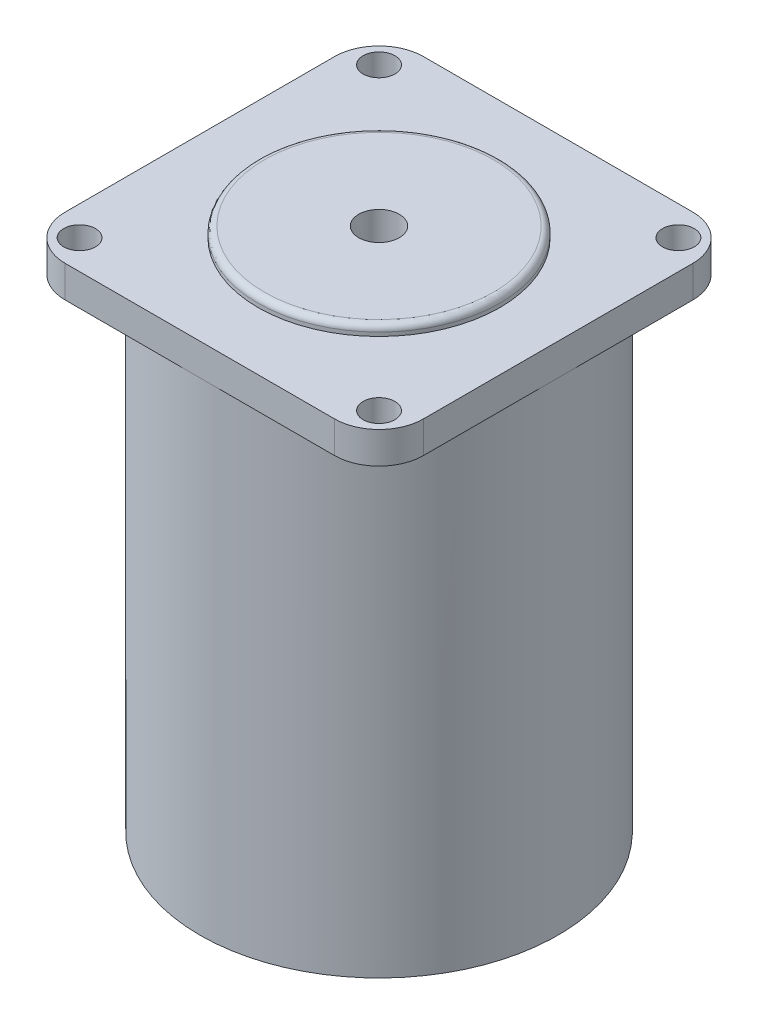
ISO-10303-21;
HEADER;
FILE_DESCRIPTION(('STEP AP214'),'2;1');
FILE_NAME('part.step','',(''),(''),'','','');
FILE_SCHEMA(('AUTOMOTIVE_DESIGN { 1 0 10303 214 1 1 1 1 }'));
ENDSEC;
DATA;
#1=APPLICATION_CONTEXT('core data for automotive mechanical design processes');
#2=APPLICATION_PROTOCOL_DEFINITION('international standard','automotive_design',2000,#1);
#3=PRODUCT_CONTEXT('',#1,'mechanical');
#4=PRODUCT('Part','Part','',(#3));
#5=PRODUCT_RELATED_PRODUCT_CATEGORY('part','',(#4));
#6=PRODUCT_DEFINITION_FORMATION('','',#4);
#7=PRODUCT_DEFINITION_CONTEXT('part definition',#1,'design');
#8=PRODUCT_DEFINITION('design','',#6,#7);
#9=PRODUCT_DEFINITION_SHAPE('','',#8);
#10=(LENGTH_UNIT() NAMED_UNIT(*) SI_UNIT(.MILLI.,.METRE.));
#11=(NAMED_UNIT(*) PLANE_ANGLE_UNIT() SI_UNIT($,.RADIAN.));
#12=(NAMED_UNIT(*) SI_UNIT($,.STERADIAN.) SOLID_ANGLE_UNIT());
#13=UNCERTAINTY_MEASURE_WITH_UNIT(LENGTH_MEASURE(1.E-05),#10,'distance_accuracy_value','');
#14=(GEOMETRIC_REPRESENTATION_CONTEXT(3) GLOBAL_UNCERTAINTY_ASSIGNED_CONTEXT((#13)) GLOBAL_UNIT_ASSIGNED_CONTEXT((#10,
#11,#12)) REPRESENTATION_CONTEXT('',''));
#15=CARTESIAN_POINT('',(0.,0.,0.));
#16=DIRECTION('',(0.,0.,1.));
#17=DIRECTION('',(1.,0.,0.));
#18=AXIS2_PLACEMENT_3D('',#15,#16,#17);
#19=CARTESIAN_POINT('',(0.,76.,0.));
#20=DIRECTION('',(0.,-1.,0.));
#21=DIRECTION('',(0.,0.,-1.));
#22=AXIS2_PLACEMENT_3D('',#19,#20,#21);
#23=CYLINDRICAL_SURFACE('',#22,28.2);
#24=CARTESIAN_POINT('',(0.,76.,0.));
#25=DIRECTION('',(0.,1.,0.));
#26=DIRECTION('',(0.,0.,1.));
#27=AXIS2_PLACEMENT_3D('',#24,#25,#26);
#28=CIRCLE('',#27,28.2);
#29=CARTESIAN_POINT('',(0.,76.,28.2));
#30=VERTEX_POINT('',#29);
#31=CARTESIAN_POINT('',(28.2,76.,0.));
#32=VERTEX_POINT('',#31);
#33=EDGE_CURVE('E141',#30,#32,#28,.T.);
#34=ORIENTED_EDGE('',*,*,#33,.F.);
#35=CARTESIAN_POINT('',(-28.2,76.,0.));
#36=VERTEX_POINT('',#35);
#37=EDGE_CURVE('E47',#36,#30,#28,.T.);
#38=ORIENTED_EDGE('',*,*,#37,.F.);
#39=CARTESIAN_POINT('',(0.,76.,-28.2));
#40=VERTEX_POINT('',#39);
#41=EDGE_CURVE('E51',#40,#36,#28,.T.);
#42=ORIENTED_EDGE('',*,*,#41,.F.);
#43=EDGE_CURVE('E143',#32,#40,#28,.T.);
#44=ORIENTED_EDGE('',*,*,#43,.F.);
#45=EDGE_LOOP('',(#34,#38,#42,#44));
#46=FACE_BOUND('',#45,.T.);
#47=CARTESIAN_POINT('',(0.,0.,0.));
#48=DIRECTION('',(0.,1.,0.));
#49=DIRECTION('',(0.,0.,1.));
#50=AXIS2_PLACEMENT_3D('',#47,#48,#49);
#51=CIRCLE('',#50,28.2);
#52=CARTESIAN_POINT('',(0.,0.,28.2));
#53=VERTEX_POINT('',#52);
#54=EDGE_CURVE('E133',#53,#53,#51,.T.);
#55=ORIENTED_EDGE('',*,*,#54,.T.);
#56=EDGE_LOOP('',(#55));
#57=FACE_BOUND('',#56,.T.);
#58=ADVANCED_FACE('F32',(#46,#57),#23,.T.);
#59=CARTESIAN_POINT('',(0.,0.,0.));
#60=DIRECTION('',(0.,1.,0.));
#61=DIRECTION('',(0.,0.,1.));
#62=AXIS2_PLACEMENT_3D('',#59,#60,#61);
#63=PLANE('',#62);
#64=CARTESIAN_POINT('',(0.,0.,0.));
#65=DIRECTION('',(0.,1.,0.));
#66=DIRECTION('',(0.,0.,1.));
#67=AXIS2_PLACEMENT_3D('',#64,#65,#66);
#68=CIRCLE('',#67,3.2);
#69=CARTESIAN_POINT('',(0.,0.,3.2));
#70=VERTEX_POINT('',#69);
#71=EDGE_CURVE('E233',#70,#70,#68,.T.);
#72=ORIENTED_EDGE('',*,*,#71,.T.);
#73=EDGE_LOOP('',(#72));
#74=FACE_BOUND('',#73,.T.);
#75=ORIENTED_EDGE('',*,*,#54,.F.);
#76=EDGE_LOOP('',(#75));
#77=FACE_BOUND('',#76,.T.);
#78=ADVANCED_FACE('F163',(#74,#77),#63,.F.);
#79=CARTESIAN_POINT('',(-21.2,76.,-21.2));
#80=DIRECTION('',(0.,1.,0.));
#81=DIRECTION('',(0.,0.,1.));
#82=AXIS2_PLACEMENT_3D('',#79,#80,#81);
#83=PLANE('',#82);
#84=CARTESIAN_POINT('',(23.57,76.,23.57));
#85=DIRECTION('',(0.,1.,0.));
#86=DIRECTION('',(0.,0.,1.));
#87=AXIS2_PLACEMENT_3D('',#84,#85,#86);
#88=CIRCLE('',#87,2.5);
#89=CARTESIAN_POINT('',(23.57,76.,26.07));
#90=VERTEX_POINT('',#89);
#91=EDGE_CURVE('E236',#90,#90,#88,.T.);
#92=ORIENTED_EDGE('',*,*,#91,.T.);
#93=EDGE_LOOP('',(#92));
#94=FACE_BOUND('',#93,.T.);
#95=DIRECTION('',(1.,0.,0.));
#96=VECTOR('',#95,1.);
#97=CARTESIAN_POINT('',(-21.2,76.,28.2));
#98=LINE('',#97,#96);
#99=CARTESIAN_POINT('',(21.2,76.,28.2));
#100=VERTEX_POINT('',#99);
#101=EDGE_CURVE('E280',#30,#100,#98,.T.);
#102=ORIENTED_EDGE('',*,*,#101,.F.);
#103=ORIENTED_EDGE('',*,*,#33,.T.);
#104=DIRECTION('',(0.,0.,-1.));
#105=VECTOR('',#104,1.);
#106=CARTESIAN_POINT('',(28.2,76.,21.2));
#107=LINE('',#106,#105);
#108=CARTESIAN_POINT('',(28.2,76.,21.2));
#109=VERTEX_POINT('',#108);
#110=EDGE_CURVE('E287',#109,#32,#107,.T.);
#111=ORIENTED_EDGE('',*,*,#110,.F.);
#112=CARTESIAN_POINT('',(21.2,76.,21.2));
#113=DIRECTION('',(0.,1.,0.));
#114=DIRECTION('',(0.,0.,1.));
#115=AXIS2_PLACEMENT_3D('',#112,#113,#114);
#116=CIRCLE('',#115,7.);
#117=EDGE_CURVE('E284',#100,#109,#116,.T.);
#118=ORIENTED_EDGE('',*,*,#117,.F.);
#119=EDGE_LOOP('',(#102,#103,#111,#118));
#120=FACE_BOUND('',#119,.T.);
#121=ADVANCED_FACE('F167',(#94,#120),#83,.F.);
#122=CARTESIAN_POINT('',(23.57,76.,-23.57));
#123=DIRECTION('',(0.,1.,0.));
#124=DIRECTION('',(0.,0.,1.));
#125=AXIS2_PLACEMENT_3D('',#122,#123,#124);
#126=CIRCLE('',#125,2.5);
#127=CARTESIAN_POINT('',(23.57,76.,-21.07));
#128=VERTEX_POINT('',#127);
#129=EDGE_CURVE('E246',#128,#128,#126,.T.);
#130=ORIENTED_EDGE('',*,*,#129,.T.);
#131=EDGE_LOOP('',(#130));
#132=FACE_BOUND('',#131,.T.);
#133=CARTESIAN_POINT('',(28.2,76.,-21.2));
#134=VERTEX_POINT('',#133);
#135=EDGE_CURVE('E286',#32,#134,#107,.T.);
#136=ORIENTED_EDGE('',*,*,#135,.F.);
#137=ORIENTED_EDGE('',*,*,#43,.T.);
#138=DIRECTION('',(-1.,0.,0.));
#139=VECTOR('',#138,1.);
#140=CARTESIAN_POINT('',(-21.2,76.,-28.2));
#141=LINE('',#140,#139);
#142=CARTESIAN_POINT('',(21.2,76.,-28.2));
#143=VERTEX_POINT('',#142);
#144=EDGE_CURVE('E128',#143,#40,#141,.T.);
#145=ORIENTED_EDGE('',*,*,#144,.F.);
#146=CARTESIAN_POINT('',(21.2,76.,-21.2));
#147=DIRECTION('',(0.,1.,0.));
#148=DIRECTION('',(0.,0.,1.));
#149=AXIS2_PLACEMENT_3D('',#146,#147,#148);
#150=CIRCLE('',#149,7.);
#151=EDGE_CURVE('E290',#134,#143,#150,.T.);
#152=ORIENTED_EDGE('',*,*,#151,.F.);
#153=EDGE_LOOP('',(#136,#137,#145,#152));
#154=FACE_BOUND('',#153,.T.);
#155=ADVANCED_FACE('F203',(#132,#154),#83,.F.);
#156=CARTESIAN_POINT('',(-23.57,76.,-23.57));
#157=DIRECTION('',(0.,1.,0.));
#158=DIRECTION('',(0.,0.,1.));
#159=AXIS2_PLACEMENT_3D('',#156,#157,#158);
#160=CIRCLE('',#159,2.5);
#161=CARTESIAN_POINT('',(-23.57,76.,-21.07));
#162=VERTEX_POINT('',#161);
#163=EDGE_CURVE('E258',#162,#162,#160,.T.);
#164=ORIENTED_EDGE('',*,*,#163,.T.);
#165=EDGE_LOOP('',(#164));
#166=FACE_BOUND('',#165,.T.);
#167=CARTESIAN_POINT('',(-21.2,76.,-28.2));
#168=VERTEX_POINT('',#167);
#169=EDGE_CURVE('E292',#40,#168,#141,.T.);
#170=ORIENTED_EDGE('',*,*,#169,.F.);
#171=ORIENTED_EDGE('',*,*,#41,.T.);
#172=DIRECTION('',(0.,0.,1.));
#173=VECTOR('',#172,1.);
#174=CARTESIAN_POINT('',(-28.2,76.,21.2));
#175=LINE('',#174,#173);
#176=CARTESIAN_POINT('',(-28.2,76.,-21.2));
#177=VERTEX_POINT('',#176);
#178=EDGE_CURVE('E276',#177,#36,#175,.T.);
#179=ORIENTED_EDGE('',*,*,#178,.F.);
#180=CARTESIAN_POINT('',(-21.2,76.,-21.2));
#181=DIRECTION('',(0.,1.,0.));
#182=DIRECTION('',(0.,0.,1.));
#183=AXIS2_PLACEMENT_3D('',#180,#181,#182);
#184=CIRCLE('',#183,7.);
#185=EDGE_CURVE('E132',#168,#177,#184,.T.);
#186=ORIENTED_EDGE('',*,*,#185,.F.);
#187=EDGE_LOOP('',(#170,#171,#179,#186));
#188=FACE_BOUND('',#187,.T.);
#189=ADVANCED_FACE('F330',(#166,#188),#83,.F.);
#190=CARTESIAN_POINT('',(-23.57,76.,23.57));
#191=DIRECTION('',(0.,1.,0.));
#192=DIRECTION('',(0.,0.,1.));
#193=AXIS2_PLACEMENT_3D('',#190,#191,#192);
#194=CIRCLE('',#193,2.5);
#195=CARTESIAN_POINT('',(-23.57,76.,26.07));
#196=VERTEX_POINT('',#195);
#197=EDGE_CURVE('E253',#196,#196,#194,.T.);
#198=ORIENTED_EDGE('',*,*,#197,.T.);
#199=EDGE_LOOP('',(#198));
#200=FACE_BOUND('',#199,.T.);
#201=CARTESIAN_POINT('',(-28.2,76.,21.2));
#202=VERTEX_POINT('',#201);
#203=EDGE_CURVE('E275',#36,#202,#175,.T.);
#204=ORIENTED_EDGE('',*,*,#203,.F.);
#205=ORIENTED_EDGE('',*,*,#37,.T.);
#206=CARTESIAN_POINT('',(-21.2,76.,28.2));
#207=VERTEX_POINT('',#206);
#208=EDGE_CURVE('E281',#207,#30,#98,.T.);
#209=ORIENTED_EDGE('',*,*,#208,.F.);
#210=CARTESIAN_POINT('',(-21.2,76.,21.2));
#211=DIRECTION('',(0.,1.,0.));
#212=DIRECTION('',(0.,0.,-1.));
#213=AXIS2_PLACEMENT_3D('',#210,#211,#212);
#214=CIRCLE('',#213,7.);
#215=EDGE_CURVE('E278',#202,#207,#214,.T.);
#216=ORIENTED_EDGE('',*,*,#215,.F.);
#217=EDGE_LOOP('',(#204,#205,#209,#216));
#218=FACE_BOUND('',#217,.T.);
#219=ADVANCED_FACE('F174',(#200,#218),#83,.F.);
#220=CARTESIAN_POINT('',(-21.2,81.,-21.2));
#221=DIRECTION('',(0.,-1.,0.));
#222=DIRECTION('',(0.,0.,-1.));
#223=AXIS2_PLACEMENT_3D('',#220,#221,#222);
#224=CYLINDRICAL_SURFACE('',#223,7.);
#225=ORIENTED_EDGE('',*,*,#185,.T.);
#226=DIRECTION('',(0.,-1.,0.));
#227=VECTOR('',#226,1.);
#228=CARTESIAN_POINT('',(-28.2,81.,-21.2));
#229=LINE('',#228,#227);
#230=CARTESIAN_POINT('',(-28.2,81.,-21.2));
#231=VERTEX_POINT('',#230);
#232=EDGE_CURVE('E112',#231,#177,#229,.T.);
#233=ORIENTED_EDGE('',*,*,#232,.F.);
#234=CARTESIAN_POINT('',(-21.2,81.,-21.2));
#235=DIRECTION('',(0.,1.,0.));
#236=DIRECTION('',(0.,0.,1.));
#237=AXIS2_PLACEMENT_3D('',#234,#235,#236);
#238=CIRCLE('',#237,7.);
#239=CARTESIAN_POINT('',(-21.2,81.,-28.2));
#240=VERTEX_POINT('',#239);
#241=EDGE_CURVE('E119',#240,#231,#238,.T.);
#242=ORIENTED_EDGE('',*,*,#241,.F.);
#243=DIRECTION('',(0.,-1.,0.));
#244=VECTOR('',#243,1.);
#245=CARTESIAN_POINT('',(-21.2,81.,-28.2));
#246=LINE('',#245,#244);
#247=EDGE_CURVE('E273',#240,#168,#246,.T.);
#248=ORIENTED_EDGE('',*,*,#247,.T.);
#249=EDGE_LOOP('',(#225,#233,#242,#248));
#250=FACE_BOUND('',#249,.T.);
#251=ADVANCED_FACE('F130',(#250),#224,.T.);
#252=CARTESIAN_POINT('',(-28.2,81.,21.2));
#253=DIRECTION('',(1.,0.,0.));
#254=DIRECTION('',(0.,0.,-1.));
#255=AXIS2_PLACEMENT_3D('',#252,#253,#254);
#256=PLANE('',#255);
#257=ORIENTED_EDGE('',*,*,#178,.T.);
#258=ORIENTED_EDGE('',*,*,#203,.T.);
#259=DIRECTION('',(0.,-1.,0.));
#260=VECTOR('',#259,1.);
#261=CARTESIAN_POINT('',(-28.2,81.,21.2));
#262=LINE('',#261,#260);
#263=CARTESIAN_POINT('',(-28.2,81.,21.2));
#264=VERTEX_POINT('',#263);
#265=EDGE_CURVE('E115',#264,#202,#262,.T.);
#266=ORIENTED_EDGE('',*,*,#265,.F.);
#267=DIRECTION('',(0.,0.,1.));
#268=VECTOR('',#267,1.);
#269=CARTESIAN_POINT('',(-28.2,81.,21.2));
#270=LINE('',#269,#268);
#271=EDGE_CURVE('E107',#231,#264,#270,.T.);
#272=ORIENTED_EDGE('',*,*,#271,.F.);
#273=ORIENTED_EDGE('',*,*,#232,.T.);
#274=EDGE_LOOP('',(#257,#258,#266,#272,#273));
#275=FACE_BOUND('',#274,.T.);
#276=ADVANCED_FACE('F110',(#275),#256,.F.);
#277=CARTESIAN_POINT('',(-21.2,81.,21.2));
#278=DIRECTION('',(0.,-1.,0.));
#279=DIRECTION('',(0.,0.,-1.));
#280=AXIS2_PLACEMENT_3D('',#277,#278,#279);
#281=CYLINDRICAL_SURFACE('',#280,7.);
#282=ORIENTED_EDGE('',*,*,#215,.T.);
#283=DIRECTION('',(0.,-1.,0.));
#284=VECTOR('',#283,1.);
#285=CARTESIAN_POINT('',(-21.2,81.,28.2));
#286=LINE('',#285,#284);
#287=CARTESIAN_POINT('',(-21.2,81.,28.2));
#288=VERTEX_POINT('',#287);
#289=EDGE_CURVE('E137',#288,#207,#286,.T.);
#290=ORIENTED_EDGE('',*,*,#289,.F.);
#291=CARTESIAN_POINT('',(-21.2,81.,21.2));
#292=DIRECTION('',(0.,1.,0.));
#293=DIRECTION('',(0.,0.,-1.));
#294=AXIS2_PLACEMENT_3D('',#291,#292,#293);
#295=CIRCLE('',#294,7.);
#296=EDGE_CURVE('E118',#264,#288,#295,.T.);
#297=ORIENTED_EDGE('',*,*,#296,.F.);
#298=ORIENTED_EDGE('',*,*,#265,.T.);
#299=EDGE_LOOP('',(#282,#290,#297,#298));
#300=FACE_BOUND('',#299,.T.);
#301=ADVANCED_FACE('F177',(#300),#281,.T.);
#302=CARTESIAN_POINT('',(-21.2,81.,28.2));
#303=DIRECTION('',(0.,0.,-1.));
#304=DIRECTION('',(-1.,0.,0.));
#305=AXIS2_PLACEMENT_3D('',#302,#303,#304);
#306=PLANE('',#305);
#307=ORIENTED_EDGE('',*,*,#208,.T.);
#308=ORIENTED_EDGE('',*,*,#101,.T.);
#309=DIRECTION('',(0.,-1.,0.));
#310=VECTOR('',#309,1.);
#311=CARTESIAN_POINT('',(21.2,81.,28.2));
#312=LINE('',#311,#310);
#313=CARTESIAN_POINT('',(21.2,81.,28.2));
#314=VERTEX_POINT('',#313);
#315=EDGE_CURVE('E305',#314,#100,#312,.T.);
#316=ORIENTED_EDGE('',*,*,#315,.F.);
#317=DIRECTION('',(1.,0.,0.));
#318=VECTOR('',#317,1.);
#319=CARTESIAN_POINT('',(-21.2,81.,28.2));
#320=LINE('',#319,#318);
#321=EDGE_CURVE('E264',#288,#314,#320,.T.);
#322=ORIENTED_EDGE('',*,*,#321,.F.);
#323=ORIENTED_EDGE('',*,*,#289,.T.);
#324=EDGE_LOOP('',(#307,#308,#316,#322,#323));
#325=FACE_BOUND('',#324,.T.);
#326=ADVANCED_FACE('F180',(#325),#306,.F.);
#327=CARTESIAN_POINT('',(21.2,81.,21.2));
#328=DIRECTION('',(0.,-1.,0.));
#329=DIRECTION('',(0.,0.,-1.));
#330=AXIS2_PLACEMENT_3D('',#327,#328,#329);
#331=CYLINDRICAL_SURFACE('',#330,7.);
#332=ORIENTED_EDGE('',*,*,#117,.T.);
#333=DIRECTION('',(0.,-1.,0.));
#334=VECTOR('',#333,1.);
#335=CARTESIAN_POINT('',(28.2,81.,21.2));
#336=LINE('',#335,#334);
#337=CARTESIAN_POINT('',(28.2,81.,21.2));
#338=VERTEX_POINT('',#337);
#339=EDGE_CURVE('E302',#338,#109,#336,.T.);
#340=ORIENTED_EDGE('',*,*,#339,.F.);
#341=CARTESIAN_POINT('',(21.2,81.,21.2));
#342=DIRECTION('',(0.,1.,0.));
#343=DIRECTION('',(0.,0.,1.));
#344=AXIS2_PLACEMENT_3D('',#341,#342,#343);
#345=CIRCLE('',#344,7.);
#346=EDGE_CURVE('E266',#314,#338,#345,.T.);
#347=ORIENTED_EDGE('',*,*,#346,.F.);
#348=ORIENTED_EDGE('',*,*,#315,.T.);
#349=EDGE_LOOP('',(#332,#340,#347,#348));
#350=FACE_BOUND('',#349,.T.);
#351=ADVANCED_FACE('F184',(#350),#331,.T.);
#352=CARTESIAN_POINT('',(28.2,81.,21.2));
#353=DIRECTION('',(-1.,0.,0.));
#354=DIRECTION('',(0.,0.,1.));
#355=AXIS2_PLACEMENT_3D('',#352,#353,#354);
#356=PLANE('',#355);
#357=ORIENTED_EDGE('',*,*,#110,.T.);
#358=ORIENTED_EDGE('',*,*,#135,.T.);
#359=DIRECTION('',(0.,-1.,0.));
#360=VECTOR('',#359,1.);
#361=CARTESIAN_POINT('',(28.2,81.,-21.2));
#362=LINE('',#361,#360);
#363=CARTESIAN_POINT('',(28.2,81.,-21.2));
#364=VERTEX_POINT('',#363);
#365=EDGE_CURVE('E299',#364,#134,#362,.T.);
#366=ORIENTED_EDGE('',*,*,#365,.F.);
#367=DIRECTION('',(0.,0.,-1.));
#368=VECTOR('',#367,1.);
#369=CARTESIAN_POINT('',(28.2,81.,21.2));
#370=LINE('',#369,#368);
#371=EDGE_CURVE('E268',#338,#364,#370,.T.);
#372=ORIENTED_EDGE('',*,*,#371,.F.);
#373=ORIENTED_EDGE('',*,*,#339,.T.);
#374=EDGE_LOOP('',(#357,#358,#366,#372,#373));
#375=FACE_BOUND('',#374,.T.);
#376=ADVANCED_FACE('F188',(#375),#356,.F.);
#377=CARTESIAN_POINT('',(21.2,81.,-21.2));
#378=DIRECTION('',(0.,-1.,0.));
#379=DIRECTION('',(0.,0.,-1.));
#380=AXIS2_PLACEMENT_3D('',#377,#378,#379);
#381=CYLINDRICAL_SURFACE('',#380,7.);
#382=ORIENTED_EDGE('',*,*,#151,.T.);
#383=DIRECTION('',(0.,-1.,0.));
#384=VECTOR('',#383,1.);
#385=CARTESIAN_POINT('',(21.2,81.,-28.2));
#386=LINE('',#385,#384);
#387=CARTESIAN_POINT('',(21.2,81.,-28.2));
#388=VERTEX_POINT('',#387);
#389=EDGE_CURVE('E296',#388,#143,#386,.T.);
#390=ORIENTED_EDGE('',*,*,#389,.F.);
#391=CARTESIAN_POINT('',(21.2,81.,-21.2));
#392=DIRECTION('',(0.,1.,0.));
#393=DIRECTION('',(0.,0.,1.));
#394=AXIS2_PLACEMENT_3D('',#391,#392,#393);
#395=CIRCLE('',#394,7.);
#396=EDGE_CURVE('E270',#364,#388,#395,.T.);
#397=ORIENTED_EDGE('',*,*,#396,.F.);
#398=ORIENTED_EDGE('',*,*,#365,.T.);
#399=EDGE_LOOP('',(#382,#390,#397,#398));
#400=FACE_BOUND('',#399,.T.);
#401=ADVANCED_FACE('F192',(#400),#381,.T.);
#402=CARTESIAN_POINT('',(-21.2,81.,-28.2));
#403=DIRECTION('',(0.,0.,1.));
#404=DIRECTION('',(1.,0.,0.));
#405=AXIS2_PLACEMENT_3D('',#402,#403,#404);
#406=PLANE('',#405);
#407=ORIENTED_EDGE('',*,*,#144,.T.);
#408=ORIENTED_EDGE('',*,*,#169,.T.);
#409=ORIENTED_EDGE('',*,*,#247,.F.);
#410=DIRECTION('',(-1.,0.,0.));
#411=VECTOR('',#410,1.);
#412=CARTESIAN_POINT('',(-21.2,81.,-28.2));
#413=LINE('',#412,#411);
#414=EDGE_CURVE('E124',#388,#240,#413,.T.);
#415=ORIENTED_EDGE('',*,*,#414,.F.);
#416=ORIENTED_EDGE('',*,*,#389,.T.);
#417=EDGE_LOOP('',(#407,#408,#409,#415,#416));
#418=FACE_BOUND('',#417,.T.);
#419=ADVANCED_FACE('F196',(#418),#406,.F.);
#420=CARTESIAN_POINT('',(-21.2,81.,-21.2));
#421=DIRECTION('',(0.,1.,0.));
#422=DIRECTION('',(0.,0.,1.));
#423=AXIS2_PLACEMENT_3D('',#420,#421,#422);
#424=PLANE('',#423);
#425=CARTESIAN_POINT('',(0.,81.,0.));
#426=DIRECTION('',(0.,1.,0.));
#427=DIRECTION('',(0.,0.,1.));
#428=AXIS2_PLACEMENT_3D('',#425,#426,#427);
#429=CIRCLE('',#428,19.05);
#430=CARTESIAN_POINT('',(0.,81.,19.05));
#431=VERTEX_POINT('',#430);
#432=EDGE_CURVE('E231',#431,#431,#429,.T.);
#433=ORIENTED_EDGE('',*,*,#432,.F.);
#434=EDGE_LOOP('',(#433));
#435=FACE_BOUND('',#434,.T.);
#436=CARTESIAN_POINT('',(23.57,81.,-23.57));
#437=DIRECTION('',(0.,1.,0.));
#438=DIRECTION('',(0.,0.,1.));
#439=AXIS2_PLACEMENT_3D('',#436,#437,#438);
#440=CIRCLE('',#439,2.5);
#441=CARTESIAN_POINT('',(23.57,81.,-21.07));
#442=VERTEX_POINT('',#441);
#443=EDGE_CURVE('E250',#442,#442,#440,.T.);
#444=ORIENTED_EDGE('',*,*,#443,.F.);
#445=EDGE_LOOP('',(#444));
#446=FACE_BOUND('',#445,.T.);
#447=CARTESIAN_POINT('',(-23.57,81.,23.57));
#448=DIRECTION('',(0.,1.,0.));
#449=DIRECTION('',(0.,0.,1.));
#450=AXIS2_PLACEMENT_3D('',#447,#448,#449);
#451=CIRCLE('',#450,2.5);
#452=CARTESIAN_POINT('',(-23.57,81.,26.07));
#453=VERTEX_POINT('',#452);
#454=EDGE_CURVE('E244',#453,#453,#451,.T.);
#455=ORIENTED_EDGE('',*,*,#454,.F.);
#456=EDGE_LOOP('',(#455));
#457=FACE_BOUND('',#456,.T.);
#458=CARTESIAN_POINT('',(23.57,81.,23.57));
#459=DIRECTION('',(0.,1.,0.));
#460=DIRECTION('',(0.,0.,1.));
#461=AXIS2_PLACEMENT_3D('',#458,#459,#460);
#462=CIRCLE('',#461,2.5);
#463=CARTESIAN_POINT('',(23.57,81.,26.07));
#464=VERTEX_POINT('',#463);
#465=EDGE_CURVE('E232',#464,#464,#462,.T.);
#466=ORIENTED_EDGE('',*,*,#465,.F.);
#467=EDGE_LOOP('',(#466));
#468=FACE_BOUND('',#467,.T.);
#469=CARTESIAN_POINT('',(-23.57,81.,-23.57));
#470=DIRECTION('',(0.,1.,0.));
#471=DIRECTION('',(0.,0.,1.));
#472=AXIS2_PLACEMENT_3D('',#469,#470,#471);
#473=CIRCLE('',#472,2.5);
#474=CARTESIAN_POINT('',(-23.57,81.,-21.07));
#475=VERTEX_POINT('',#474);
#476=EDGE_CURVE('E249',#475,#475,#473,.T.);
#477=ORIENTED_EDGE('',*,*,#476,.F.);
#478=EDGE_LOOP('',(#477));
#479=FACE_BOUND('',#478,.T.);
#480=ORIENTED_EDGE('',*,*,#241,.T.);
#481=ORIENTED_EDGE('',*,*,#271,.T.);
#482=ORIENTED_EDGE('',*,*,#296,.T.);
#483=ORIENTED_EDGE('',*,*,#321,.T.);
#484=ORIENTED_EDGE('',*,*,#346,.T.);
#485=ORIENTED_EDGE('',*,*,#371,.T.);
#486=ORIENTED_EDGE('',*,*,#396,.T.);
#487=ORIENTED_EDGE('',*,*,#414,.T.);
#488=EDGE_LOOP('',(#480,#481,#482,#483,#484,#485,#486,#487));
#489=FACE_BOUND('',#488,.T.);
#490=ADVANCED_FACE('F122',(#435,#446,#457,#468,#479,#489),#424,.T.);
#491=CARTESIAN_POINT('',(-23.57,76.,-23.57));
#492=DIRECTION('',(0.,1.,0.));
#493=DIRECTION('',(0.,0.,1.));
#494=AXIS2_PLACEMENT_3D('',#491,#492,#493);
#495=CYLINDRICAL_SURFACE('',#494,2.5);
#496=ORIENTED_EDGE('',*,*,#163,.F.);
#497=EDGE_LOOP('',(#496));
#498=FACE_BOUND('',#497,.T.);
#499=ORIENTED_EDGE('',*,*,#476,.T.);
#500=EDGE_LOOP('',(#499));
#501=FACE_BOUND('',#500,.T.);
#502=ADVANCED_FACE('F207',(#498,#501),#495,.F.);
#503=CARTESIAN_POINT('',(23.57,76.,23.57));
#504=DIRECTION('',(0.,1.,0.));
#505=DIRECTION('',(0.,0.,1.));
#506=AXIS2_PLACEMENT_3D('',#503,#504,#505);
#507=CYLINDRICAL_SURFACE('',#506,2.5);
#508=ORIENTED_EDGE('',*,*,#91,.F.);
#509=EDGE_LOOP('',(#508));
#510=FACE_BOUND('',#509,.T.);
#511=ORIENTED_EDGE('',*,*,#465,.T.);
#512=EDGE_LOOP('',(#511));
#513=FACE_BOUND('',#512,.T.);
#514=ADVANCED_FACE('F211',(#510,#513),#507,.F.);
#515=CARTESIAN_POINT('',(-23.57,76.,23.57));
#516=DIRECTION('',(0.,1.,0.));
#517=DIRECTION('',(0.,0.,1.));
#518=AXIS2_PLACEMENT_3D('',#515,#516,#517);
#519=CYLINDRICAL_SURFACE('',#518,2.5);
#520=ORIENTED_EDGE('',*,*,#197,.F.);
#521=EDGE_LOOP('',(#520));
#522=FACE_BOUND('',#521,.T.);
#523=ORIENTED_EDGE('',*,*,#454,.T.);
#524=EDGE_LOOP('',(#523));
#525=FACE_BOUND('',#524,.T.);
#526=ADVANCED_FACE('F213',(#522,#525),#519,.F.);
#527=CARTESIAN_POINT('',(23.57,76.,-23.57));
#528=DIRECTION('',(0.,1.,0.));
#529=DIRECTION('',(0.,0.,1.));
#530=AXIS2_PLACEMENT_3D('',#527,#528,#529);
#531=CYLINDRICAL_SURFACE('',#530,2.5);
#532=ORIENTED_EDGE('',*,*,#129,.F.);
#533=EDGE_LOOP('',(#532));
#534=FACE_BOUND('',#533,.T.);
#535=ORIENTED_EDGE('',*,*,#443,.T.);
#536=EDGE_LOOP('',(#535));
#537=FACE_BOUND('',#536,.T.);
#538=ADVANCED_FACE('F216',(#534,#537),#531,.F.);
#539=CARTESIAN_POINT('',(0.,82.6,0.));
#540=DIRECTION('',(0.,-1.,0.));
#541=DIRECTION('',(0.,0.,-1.));
#542=AXIS2_PLACEMENT_3D('',#539,#540,#541);
#543=CYLINDRICAL_SURFACE('',#542,19.05);
#544=CARTESIAN_POINT('',(0.,81.6,0.));
#545=DIRECTION('',(0.,1.,0.));
#546=DIRECTION('',(0.,0.,1.));
#547=AXIS2_PLACEMENT_3D('',#544,#545,#546);
#548=CIRCLE('',#547,19.05);
#549=CARTESIAN_POINT('',(0.,81.6,19.05));
#550=VERTEX_POINT('',#549);
#551=EDGE_CURVE('E11',#550,#550,#548,.F.);
#552=ORIENTED_EDGE('',*,*,#551,.T.);
#553=EDGE_LOOP('',(#552));
#554=FACE_BOUND('',#553,.T.);
#555=ORIENTED_EDGE('',*,*,#432,.T.);
#556=EDGE_LOOP('',(#555));
#557=FACE_BOUND('',#556,.T.);
#558=ADVANCED_FACE('F158',(#554,#557),#543,.T.);
#559=CARTESIAN_POINT('',(0.,82.6,0.));
#560=DIRECTION('',(0.,1.,0.));
#561=DIRECTION('',(0.,0.,1.));
#562=AXIS2_PLACEMENT_3D('',#559,#560,#561);
#563=PLANE('',#562);
#564=CARTESIAN_POINT('',(0.,82.6,0.));
#565=DIRECTION('',(0.,1.,0.));
#566=DIRECTION('',(0.,0.,1.));
#567=AXIS2_PLACEMENT_3D('',#564,#565,#566);
#568=CIRCLE('',#567,3.2);
#569=CARTESIAN_POINT('',(0.,82.6,3.2));
#570=VERTEX_POINT('',#569);
#571=EDGE_CURVE('E239',#570,#570,#568,.T.);
#572=ORIENTED_EDGE('',*,*,#571,.F.);
#573=EDGE_LOOP('',(#572));
#574=FACE_BOUND('',#573,.T.);
#575=CARTESIAN_POINT('',(0.,82.6,0.));
#576=DIRECTION('',(0.,1.,0.));
#577=DIRECTION('',(0.,0.,1.));
#578=AXIS2_PLACEMENT_3D('',#575,#576,#577);
#579=CIRCLE('',#578,18.05);
#580=CARTESIAN_POINT('',(0.,82.6,18.05));
#581=VERTEX_POINT('',#580);
#582=EDGE_CURVE('E40',#581,#581,#579,.T.);
#583=ORIENTED_EDGE('',*,*,#582,.T.);
#584=EDGE_LOOP('',(#583));
#585=FACE_BOUND('',#584,.T.);
#586=ADVANCED_FACE('F147',(#574,#585),#563,.T.);
#587=CARTESIAN_POINT('',(0.,81.6,0.));
#588=DIRECTION('',(0.,1.,0.));
#589=DIRECTION('',(0.,0.,1.));
#590=AXIS2_PLACEMENT_3D('',#587,#588,#589);
#591=TOROIDAL_SURFACE('',#590,18.05,1.);
#592=ORIENTED_EDGE('',*,*,#551,.F.);
#593=EDGE_LOOP('',(#592));
#594=FACE_BOUND('',#593,.T.);
#595=ORIENTED_EDGE('',*,*,#582,.F.);
#596=EDGE_LOOP('',(#595));
#597=FACE_BOUND('',#596,.T.);
#598=ADVANCED_FACE('F34',(#594,#597),#591,.T.);
#599=CARTESIAN_POINT('',(0.,0.,0.));
#600=DIRECTION('',(0.,1.,0.));
#601=DIRECTION('',(0.,0.,1.));
#602=AXIS2_PLACEMENT_3D('',#599,#600,#601);
#603=CYLINDRICAL_SURFACE('',#602,3.2);
#604=ORIENTED_EDGE('',*,*,#71,.F.);
#605=EDGE_LOOP('',(#604));
#606=FACE_BOUND('',#605,.T.);
#607=ORIENTED_EDGE('',*,*,#571,.T.);
#608=EDGE_LOOP('',(#607));
#609=FACE_BOUND('',#608,.T.);
#610=ADVANCED_FACE('F150',(#606,#609),#603,.F.);
#611=CLOSED_SHELL('',(#58,#78,#121,#155,#189,#219,#251,#276,#301,#326,#351,#376,#401,#419,#490,
#502,#514,#526,#538,#558,#586,#598,#610));
#612=MANIFOLD_SOLID_BREP('B2',#611);
#613=ADVANCED_BREP_SHAPE_REPRESENTATION('',(#18,#612),#14);
#614=SHAPE_DEFINITION_REPRESENTATION(#9,#613);
ENDSEC;
END-ISO-10303-21;
